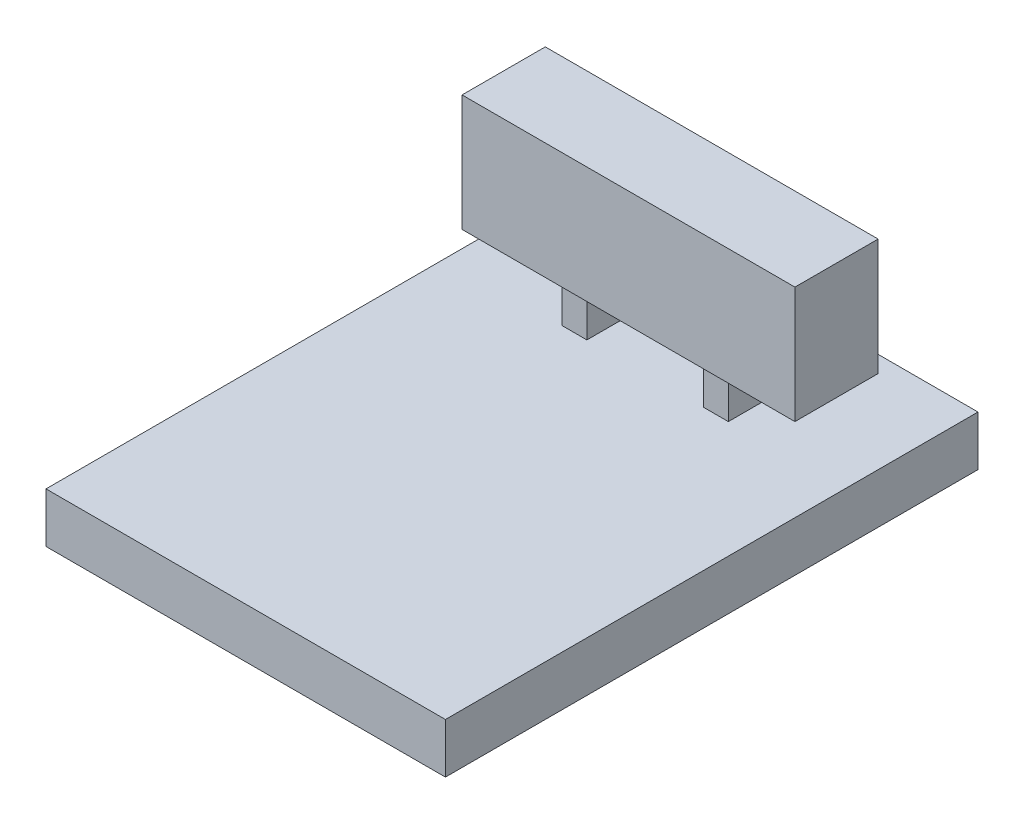
ISO-10303-21;
HEADER;
FILE_DESCRIPTION(('STEP AP214'),'2;1');
FILE_NAME('part.step','',(''),(''),'','','');
FILE_SCHEMA(('AUTOMOTIVE_DESIGN { 1 0 10303 214 1 1 1 1 }'));
ENDSEC;
DATA;
#1=APPLICATION_CONTEXT('core data for automotive mechanical design processes');
#2=APPLICATION_PROTOCOL_DEFINITION('international standard','automotive_design',2000,#1);
#3=PRODUCT_CONTEXT('',#1,'mechanical');
#4=PRODUCT('Part','Part','',(#3));
#5=PRODUCT_RELATED_PRODUCT_CATEGORY('part','',(#4));
#6=PRODUCT_DEFINITION_FORMATION('','',#4);
#7=PRODUCT_DEFINITION_CONTEXT('part definition',#1,'design');
#8=PRODUCT_DEFINITION('design','',#6,#7);
#9=PRODUCT_DEFINITION_SHAPE('','',#8);
#10=(LENGTH_UNIT() NAMED_UNIT(*) SI_UNIT(.MILLI.,.METRE.));
#11=(NAMED_UNIT(*) PLANE_ANGLE_UNIT() SI_UNIT($,.RADIAN.));
#12=(NAMED_UNIT(*) SI_UNIT($,.STERADIAN.) SOLID_ANGLE_UNIT());
#13=UNCERTAINTY_MEASURE_WITH_UNIT(LENGTH_MEASURE(1.E-05),#10,'distance_accuracy_value','');
#14=(GEOMETRIC_REPRESENTATION_CONTEXT(3) GLOBAL_UNCERTAINTY_ASSIGNED_CONTEXT((#13)) GLOBAL_UNIT_ASSIGNED_CONTEXT((#10,
#11,#12)) REPRESENTATION_CONTEXT('',''));
#15=CARTESIAN_POINT('',(0.,0.,0.));
#16=DIRECTION('',(0.,0.,1.));
#17=DIRECTION('',(1.,0.,0.));
#18=AXIS2_PLACEMENT_3D('',#15,#16,#17);
#19=CARTESIAN_POINT('',(0.,3.,0.));
#20=DIRECTION('',(0.,1.,0.));
#21=DIRECTION('',(0.,0.,1.));
#22=AXIS2_PLACEMENT_3D('',#19,#20,#21);
#23=PLANE('',#22);
#24=DIRECTION('',(1.,0.,0.));
#25=VECTOR('',#24,1.);
#26=CARTESIAN_POINT('',(-15.3304347826087,3.,-9.63478260869564));
#27=LINE('',#26,#25);
#28=CARTESIAN_POINT('',(-15.3304347826087,3.,-9.63478260869564));
#29=VERTEX_POINT('',#28);
#30=CARTESIAN_POINT('',(-13.8304347826087,3.,-9.63478260869564));
#31=VERTEX_POINT('',#30);
#32=EDGE_CURVE('E223',#29,#31,#27,.T.);
#33=ORIENTED_EDGE('',*,*,#32,.F.);
#34=DIRECTION('',(0.,0.,1.));
#35=VECTOR('',#34,1.);
#36=CARTESIAN_POINT('',(-15.3304347826087,3.,-12.6347826086956));
#37=LINE('',#36,#35);
#38=CARTESIAN_POINT('',(-15.3304347826087,3.,-12.6347826086956));
#39=VERTEX_POINT('',#38);
#40=EDGE_CURVE('E206',#39,#29,#37,.T.);
#41=ORIENTED_EDGE('',*,*,#40,.F.);
#42=DIRECTION('',(-1.,0.,0.));
#43=VECTOR('',#42,1.);
#44=CARTESIAN_POINT('',(-15.3304347826087,3.,-12.6347826086956));
#45=LINE('',#44,#43);
#46=CARTESIAN_POINT('',(-13.8304347826087,3.,-12.6347826086956));
#47=VERTEX_POINT('',#46);
#48=EDGE_CURVE('E211',#47,#39,#45,.T.);
#49=ORIENTED_EDGE('',*,*,#48,.F.);
#50=DIRECTION('',(0.,0.,-1.));
#51=VECTOR('',#50,1.);
#52=CARTESIAN_POINT('',(-13.8304347826087,3.,-12.6347826086956));
#53=LINE('',#52,#51);
#54=EDGE_CURVE('E225',#31,#47,#53,.T.);
#55=ORIENTED_EDGE('',*,*,#54,.F.);
#56=EDGE_LOOP('',(#33,#41,#49,#55));
#57=FACE_BOUND('',#56,.T.);
#58=DIRECTION('',(0.,0.,1.));
#59=VECTOR('',#58,1.);
#60=CARTESIAN_POINT('',(-22.3304347826087,3.,-17.6347826086956));
#61=LINE('',#60,#59);
#62=CARTESIAN_POINT('',(-22.3304347826087,3.,-17.6347826086956));
#63=VERTEX_POINT('',#62);
#64=CARTESIAN_POINT('',(-22.3304347826087,3.,14.3652173913044));
#65=VERTEX_POINT('',#64);
#66=EDGE_CURVE('E237',#63,#65,#61,.T.);
#67=ORIENTED_EDGE('',*,*,#66,.T.);
#68=DIRECTION('',(1.,0.,0.));
#69=VECTOR('',#68,1.);
#70=CARTESIAN_POINT('',(-22.3304347826087,3.,14.3652173913044));
#71=LINE('',#70,#69);
#72=CARTESIAN_POINT('',(1.66956521739132,3.,14.3652173913044));
#73=VERTEX_POINT('',#72);
#74=EDGE_CURVE('E240',#65,#73,#71,.T.);
#75=ORIENTED_EDGE('',*,*,#74,.T.);
#76=DIRECTION('',(0.,0.,-1.));
#77=VECTOR('',#76,1.);
#78=CARTESIAN_POINT('',(1.66956521739132,3.,-17.6347826086956));
#79=LINE('',#78,#77);
#80=CARTESIAN_POINT('',(1.66956521739132,3.,-17.6347826086956));
#81=VERTEX_POINT('',#80);
#82=EDGE_CURVE('E243',#73,#81,#79,.T.);
#83=ORIENTED_EDGE('',*,*,#82,.T.);
#84=DIRECTION('',(-1.,0.,0.));
#85=VECTOR('',#84,1.);
#86=CARTESIAN_POINT('',(-22.3304347826087,3.,-17.6347826086956));
#87=LINE('',#86,#85);
#88=EDGE_CURVE('E245',#81,#63,#87,.T.);
#89=ORIENTED_EDGE('',*,*,#88,.T.);
#90=EDGE_LOOP('',(#67,#75,#83,#89));
#91=FACE_BOUND('',#90,.T.);
#92=DIRECTION('',(0.,0.,1.));
#93=VECTOR('',#92,1.);
#94=CARTESIAN_POINT('',(-6.83043478260868,3.,-12.6347826086956));
#95=LINE('',#94,#93);
#96=CARTESIAN_POINT('',(-6.83043478260868,3.,-12.6347826086956));
#97=VERTEX_POINT('',#96);
#98=CARTESIAN_POINT('',(-6.83043478260868,3.,-9.63478260869564));
#99=VERTEX_POINT('',#98);
#100=EDGE_CURVE('E174',#97,#99,#95,.T.);
#101=ORIENTED_EDGE('',*,*,#100,.F.);
#102=DIRECTION('',(-1.,0.,0.));
#103=VECTOR('',#102,1.);
#104=CARTESIAN_POINT('',(-6.83043478260868,3.,-12.6347826086956));
#105=LINE('',#104,#103);
#106=CARTESIAN_POINT('',(-5.33043478260868,3.,-12.6347826086956));
#107=VERTEX_POINT('',#106);
#108=EDGE_CURVE('E171',#107,#97,#105,.T.);
#109=ORIENTED_EDGE('',*,*,#108,.F.);
#110=DIRECTION('',(0.,0.,-1.));
#111=VECTOR('',#110,1.);
#112=CARTESIAN_POINT('',(-5.33043478260868,3.,-12.6347826086956));
#113=LINE('',#112,#111);
#114=CARTESIAN_POINT('',(-5.33043478260868,3.,-9.63478260869564));
#115=VERTEX_POINT('',#114);
#116=EDGE_CURVE('E184',#115,#107,#113,.T.);
#117=ORIENTED_EDGE('',*,*,#116,.F.);
#118=DIRECTION('',(1.,0.,0.));
#119=VECTOR('',#118,1.);
#120=CARTESIAN_POINT('',(-6.83043478260868,3.,-9.63478260869564));
#121=LINE('',#120,#119);
#122=EDGE_CURVE('E195',#99,#115,#121,.T.);
#123=ORIENTED_EDGE('',*,*,#122,.F.);
#124=EDGE_LOOP('',(#101,#109,#117,#123));
#125=FACE_BOUND('',#124,.T.);
#126=ADVANCED_FACE('F33',(#57,#91,#125),#23,.T.);
#127=CARTESIAN_POINT('',(-22.3304347826087,3.,-17.6347826086956));
#128=DIRECTION('',(1.,0.,0.));
#129=DIRECTION('',(0.,0.,-1.));
#130=AXIS2_PLACEMENT_3D('',#127,#128,#129);
#131=PLANE('',#130);
#132=DIRECTION('',(0.,0.,1.));
#133=VECTOR('',#132,1.);
#134=CARTESIAN_POINT('',(-22.3304347826087,0.,-17.6347826086956));
#135=LINE('',#134,#133);
#136=CARTESIAN_POINT('',(-22.3304347826087,0.,-17.6347826086956));
#137=VERTEX_POINT('',#136);
#138=CARTESIAN_POINT('',(-22.3304347826087,0.,14.3652173913044));
#139=VERTEX_POINT('',#138);
#140=EDGE_CURVE('E236',#137,#139,#135,.T.);
#141=ORIENTED_EDGE('',*,*,#140,.T.);
#142=DIRECTION('',(0.,-1.,0.));
#143=VECTOR('',#142,1.);
#144=CARTESIAN_POINT('',(-22.3304347826087,3.,14.3652173913044));
#145=LINE('',#144,#143);
#146=EDGE_CURVE('E11',#65,#139,#145,.T.);
#147=ORIENTED_EDGE('',*,*,#146,.F.);
#148=ORIENTED_EDGE('',*,*,#66,.F.);
#149=DIRECTION('',(0.,-1.,0.));
#150=VECTOR('',#149,1.);
#151=CARTESIAN_POINT('',(-22.3304347826087,3.,-17.6347826086956));
#152=LINE('',#151,#150);
#153=EDGE_CURVE('E247',#63,#137,#152,.T.);
#154=ORIENTED_EDGE('',*,*,#153,.T.);
#155=EDGE_LOOP('',(#141,#147,#148,#154));
#156=FACE_BOUND('',#155,.T.);
#157=ADVANCED_FACE('F35',(#156),#131,.F.);
#158=CARTESIAN_POINT('',(-22.3304347826087,3.,14.3652173913044));
#159=DIRECTION('',(0.,0.,-1.));
#160=DIRECTION('',(-1.,0.,0.));
#161=AXIS2_PLACEMENT_3D('',#158,#159,#160);
#162=PLANE('',#161);
#163=DIRECTION('',(1.,0.,0.));
#164=VECTOR('',#163,1.);
#165=CARTESIAN_POINT('',(-22.3304347826087,0.,14.3652173913044));
#166=LINE('',#165,#164);
#167=CARTESIAN_POINT('',(1.66956521739132,0.,14.3652173913044));
#168=VERTEX_POINT('',#167);
#169=EDGE_CURVE('E250',#139,#168,#166,.T.);
#170=ORIENTED_EDGE('',*,*,#169,.T.);
#171=DIRECTION('',(0.,-1.,0.));
#172=VECTOR('',#171,1.);
#173=CARTESIAN_POINT('',(1.66956521739132,3.,14.3652173913044));
#174=LINE('',#173,#172);
#175=EDGE_CURVE('E41',#73,#168,#174,.T.);
#176=ORIENTED_EDGE('',*,*,#175,.F.);
#177=ORIENTED_EDGE('',*,*,#74,.F.);
#178=ORIENTED_EDGE('',*,*,#146,.T.);
#179=EDGE_LOOP('',(#170,#176,#177,#178));
#180=FACE_BOUND('',#179,.T.);
#181=ADVANCED_FACE('F280',(#180),#162,.F.);
#182=CARTESIAN_POINT('',(1.66956521739132,3.,-17.6347826086956));
#183=DIRECTION('',(-1.,0.,0.));
#184=DIRECTION('',(0.,0.,1.));
#185=AXIS2_PLACEMENT_3D('',#182,#183,#184);
#186=PLANE('',#185);
#187=DIRECTION('',(0.,0.,-1.));
#188=VECTOR('',#187,1.);
#189=CARTESIAN_POINT('',(1.66956521739132,0.,-17.6347826086956));
#190=LINE('',#189,#188);
#191=CARTESIAN_POINT('',(1.66956521739132,0.,-17.6347826086956));
#192=VERTEX_POINT('',#191);
#193=EDGE_CURVE('E252',#168,#192,#190,.T.);
#194=ORIENTED_EDGE('',*,*,#193,.T.);
#195=DIRECTION('',(0.,-1.,0.));
#196=VECTOR('',#195,1.);
#197=CARTESIAN_POINT('',(1.66956521739132,3.,-17.6347826086956));
#198=LINE('',#197,#196);
#199=EDGE_CURVE('E257',#81,#192,#198,.T.);
#200=ORIENTED_EDGE('',*,*,#199,.F.);
#201=ORIENTED_EDGE('',*,*,#82,.F.);
#202=ORIENTED_EDGE('',*,*,#175,.T.);
#203=EDGE_LOOP('',(#194,#200,#201,#202));
#204=FACE_BOUND('',#203,.T.);
#205=ADVANCED_FACE('F264',(#204),#186,.F.);
#206=CARTESIAN_POINT('',(-22.3304347826087,3.,-17.6347826086956));
#207=DIRECTION('',(0.,0.,1.));
#208=DIRECTION('',(1.,0.,0.));
#209=AXIS2_PLACEMENT_3D('',#206,#207,#208);
#210=PLANE('',#209);
#211=DIRECTION('',(-1.,0.,0.));
#212=VECTOR('',#211,1.);
#213=CARTESIAN_POINT('',(-22.3304347826087,0.,-17.6347826086956));
#214=LINE('',#213,#212);
#215=EDGE_CURVE('E241',#192,#137,#214,.T.);
#216=ORIENTED_EDGE('',*,*,#215,.T.);
#217=ORIENTED_EDGE('',*,*,#153,.F.);
#218=ORIENTED_EDGE('',*,*,#88,.F.);
#219=ORIENTED_EDGE('',*,*,#199,.T.);
#220=EDGE_LOOP('',(#216,#217,#218,#219));
#221=FACE_BOUND('',#220,.T.);
#222=ADVANCED_FACE('F273',(#221),#210,.F.);
#223=CARTESIAN_POINT('',(0.,0.,0.));
#224=DIRECTION('',(0.,1.,0.));
#225=DIRECTION('',(0.,0.,1.));
#226=AXIS2_PLACEMENT_3D('',#223,#224,#225);
#227=PLANE('',#226);
#228=ORIENTED_EDGE('',*,*,#140,.F.);
#229=ORIENTED_EDGE('',*,*,#215,.F.);
#230=ORIENTED_EDGE('',*,*,#193,.F.);
#231=ORIENTED_EDGE('',*,*,#169,.F.);
#232=EDGE_LOOP('',(#228,#229,#230,#231));
#233=FACE_BOUND('',#232,.T.);
#234=ADVANCED_FACE('F270',(#233),#227,.F.);
#235=CARTESIAN_POINT('',(-15.3304347826087,6.,-12.6347826086956));
#236=DIRECTION('',(1.,0.,0.));
#237=DIRECTION('',(0.,0.,-1.));
#238=AXIS2_PLACEMENT_3D('',#235,#236,#237);
#239=PLANE('',#238);
#240=ORIENTED_EDGE('',*,*,#40,.T.);
#241=DIRECTION('',(0.,-1.,0.));
#242=VECTOR('',#241,1.);
#243=CARTESIAN_POINT('',(-15.3304347826087,6.,-9.63478260869564));
#244=LINE('',#243,#242);
#245=CARTESIAN_POINT('',(-15.3304347826087,6.,-9.63478260869564));
#246=VERTEX_POINT('',#245);
#247=EDGE_CURVE('E234',#246,#29,#244,.T.);
#248=ORIENTED_EDGE('',*,*,#247,.F.);
#249=DIRECTION('',(0.,0.,1.));
#250=VECTOR('',#249,1.);
#251=CARTESIAN_POINT('',(-15.3304347826087,6.,-12.6347826086956));
#252=LINE('',#251,#250);
#253=CARTESIAN_POINT('',(-15.3304347826087,6.,-12.6347826086956));
#254=VERTEX_POINT('',#253);
#255=EDGE_CURVE('E207',#254,#246,#252,.T.);
#256=ORIENTED_EDGE('',*,*,#255,.F.);
#257=DIRECTION('',(0.,-1.,0.));
#258=VECTOR('',#257,1.);
#259=CARTESIAN_POINT('',(-15.3304347826087,6.,-12.6347826086956));
#260=LINE('',#259,#258);
#261=EDGE_CURVE('E220',#254,#39,#260,.T.);
#262=ORIENTED_EDGE('',*,*,#261,.T.);
#263=EDGE_LOOP('',(#240,#248,#256,#262));
#264=FACE_BOUND('',#263,.T.);
#265=ADVANCED_FACE('F295',(#264),#239,.F.);
#266=CARTESIAN_POINT('',(-15.3304347826087,6.,-9.63478260869564));
#267=DIRECTION('',(0.,0.,-1.));
#268=DIRECTION('',(-1.,0.,0.));
#269=AXIS2_PLACEMENT_3D('',#266,#267,#268);
#270=PLANE('',#269);
#271=ORIENTED_EDGE('',*,*,#32,.T.);
#272=DIRECTION('',(0.,-1.,0.));
#273=VECTOR('',#272,1.);
#274=CARTESIAN_POINT('',(-13.8304347826087,6.,-9.63478260869564));
#275=LINE('',#274,#273);
#276=CARTESIAN_POINT('',(-13.8304347826087,6.,-9.63478260869564));
#277=VERTEX_POINT('',#276);
#278=EDGE_CURVE('E231',#277,#31,#275,.T.);
#279=ORIENTED_EDGE('',*,*,#278,.F.);
#280=DIRECTION('',(1.,0.,0.));
#281=VECTOR('',#280,1.);
#282=CARTESIAN_POINT('',(-15.3304347826087,6.,-9.63478260869564));
#283=LINE('',#282,#281);
#284=EDGE_CURVE('E210',#246,#277,#283,.T.);
#285=ORIENTED_EDGE('',*,*,#284,.F.);
#286=ORIENTED_EDGE('',*,*,#247,.T.);
#287=EDGE_LOOP('',(#271,#279,#285,#286));
#288=FACE_BOUND('',#287,.T.);
#289=ADVANCED_FACE('F314',(#288),#270,.F.);
#290=CARTESIAN_POINT('',(-13.8304347826087,6.,-12.6347826086956));
#291=DIRECTION('',(-1.,0.,0.));
#292=DIRECTION('',(0.,0.,1.));
#293=AXIS2_PLACEMENT_3D('',#290,#291,#292);
#294=PLANE('',#293);
#295=ORIENTED_EDGE('',*,*,#54,.T.);
#296=DIRECTION('',(0.,-1.,0.));
#297=VECTOR('',#296,1.);
#298=CARTESIAN_POINT('',(-13.8304347826087,6.,-12.6347826086956));
#299=LINE('',#298,#297);
#300=CARTESIAN_POINT('',(-13.8304347826087,6.,-12.6347826086956));
#301=VERTEX_POINT('',#300);
#302=EDGE_CURVE('E56',#301,#47,#299,.T.);
#303=ORIENTED_EDGE('',*,*,#302,.F.);
#304=DIRECTION('',(0.,0.,-1.));
#305=VECTOR('',#304,1.);
#306=CARTESIAN_POINT('',(-13.8304347826087,6.,-12.6347826086956));
#307=LINE('',#306,#305);
#308=EDGE_CURVE('E214',#277,#301,#307,.T.);
#309=ORIENTED_EDGE('',*,*,#308,.F.);
#310=ORIENTED_EDGE('',*,*,#278,.T.);
#311=EDGE_LOOP('',(#295,#303,#309,#310));
#312=FACE_BOUND('',#311,.T.);
#313=ADVANCED_FACE('F321',(#312),#294,.F.);
#314=CARTESIAN_POINT('',(-15.3304347826087,6.,-12.6347826086956));
#315=DIRECTION('',(0.,0.,1.));
#316=DIRECTION('',(1.,0.,0.));
#317=AXIS2_PLACEMENT_3D('',#314,#315,#316);
#318=PLANE('',#317);
#319=ORIENTED_EDGE('',*,*,#48,.T.);
#320=ORIENTED_EDGE('',*,*,#261,.F.);
#321=DIRECTION('',(-1.,0.,0.));
#322=VECTOR('',#321,1.);
#323=CARTESIAN_POINT('',(-15.3304347826087,6.,-12.6347826086956));
#324=LINE('',#323,#322);
#325=EDGE_CURVE('E217',#301,#254,#324,.T.);
#326=ORIENTED_EDGE('',*,*,#325,.F.);
#327=ORIENTED_EDGE('',*,*,#302,.T.);
#328=EDGE_LOOP('',(#319,#320,#326,#327));
#329=FACE_BOUND('',#328,.T.);
#330=ADVANCED_FACE('F328',(#329),#318,.F.);
#331=CARTESIAN_POINT('',(-6.83043478260868,6.,-12.6347826086956));
#332=DIRECTION('',(0.,0.,1.));
#333=DIRECTION('',(1.,0.,0.));
#334=AXIS2_PLACEMENT_3D('',#331,#332,#333);
#335=PLANE('',#334);
#336=ORIENTED_EDGE('',*,*,#108,.T.);
#337=DIRECTION('',(0.,-1.,0.));
#338=VECTOR('',#337,1.);
#339=CARTESIAN_POINT('',(-6.83043478260868,6.,-12.6347826086956));
#340=LINE('',#339,#338);
#341=CARTESIAN_POINT('',(-6.83043478260868,6.,-12.6347826086956));
#342=VERTEX_POINT('',#341);
#343=EDGE_CURVE('E204',#342,#97,#340,.T.);
#344=ORIENTED_EDGE('',*,*,#343,.F.);
#345=DIRECTION('',(-1.,0.,0.));
#346=VECTOR('',#345,1.);
#347=CARTESIAN_POINT('',(-6.83043478260868,6.,-12.6347826086956));
#348=LINE('',#347,#346);
#349=CARTESIAN_POINT('',(-5.33043478260868,6.,-12.6347826086956));
#350=VERTEX_POINT('',#349);
#351=EDGE_CURVE('E180',#350,#342,#348,.T.);
#352=ORIENTED_EDGE('',*,*,#351,.F.);
#353=DIRECTION('',(0.,-1.,0.));
#354=VECTOR('',#353,1.);
#355=CARTESIAN_POINT('',(-5.33043478260868,6.,-12.6347826086956));
#356=LINE('',#355,#354);
#357=EDGE_CURVE('E192',#350,#107,#356,.T.);
#358=ORIENTED_EDGE('',*,*,#357,.T.);
#359=EDGE_LOOP('',(#336,#344,#352,#358));
#360=FACE_BOUND('',#359,.T.);
#361=ADVANCED_FACE('F336',(#360),#335,.F.);
#362=CARTESIAN_POINT('',(-6.83043478260868,6.,-12.6347826086956));
#363=DIRECTION('',(1.,0.,0.));
#364=DIRECTION('',(0.,0.,-1.));
#365=AXIS2_PLACEMENT_3D('',#362,#363,#364);
#366=PLANE('',#365);
#367=ORIENTED_EDGE('',*,*,#100,.T.);
#368=DIRECTION('',(0.,-1.,0.));
#369=VECTOR('',#368,1.);
#370=CARTESIAN_POINT('',(-6.83043478260868,6.,-9.63478260869564));
#371=LINE('',#370,#369);
#372=CARTESIAN_POINT('',(-6.83043478260868,6.,-9.63478260869564));
#373=VERTEX_POINT('',#372);
#374=EDGE_CURVE('E201',#373,#99,#371,.T.);
#375=ORIENTED_EDGE('',*,*,#374,.F.);
#376=DIRECTION('',(0.,0.,1.));
#377=VECTOR('',#376,1.);
#378=CARTESIAN_POINT('',(-6.83043478260868,6.,-12.6347826086956));
#379=LINE('',#378,#377);
#380=EDGE_CURVE('E183',#342,#373,#379,.T.);
#381=ORIENTED_EDGE('',*,*,#380,.F.);
#382=ORIENTED_EDGE('',*,*,#343,.T.);
#383=EDGE_LOOP('',(#367,#375,#381,#382));
#384=FACE_BOUND('',#383,.T.);
#385=ADVANCED_FACE('F343',(#384),#366,.F.);
#386=CARTESIAN_POINT('',(-6.83043478260868,6.,-9.63478260869564));
#387=DIRECTION('',(0.,0.,-1.));
#388=DIRECTION('',(-1.,0.,0.));
#389=AXIS2_PLACEMENT_3D('',#386,#387,#388);
#390=PLANE('',#389);
#391=ORIENTED_EDGE('',*,*,#122,.T.);
#392=DIRECTION('',(0.,-1.,0.));
#393=VECTOR('',#392,1.);
#394=CARTESIAN_POINT('',(-5.33043478260868,6.,-9.63478260869564));
#395=LINE('',#394,#393);
#396=CARTESIAN_POINT('',(-5.33043478260868,6.,-9.63478260869564));
#397=VERTEX_POINT('',#396);
#398=EDGE_CURVE('E48',#397,#115,#395,.T.);
#399=ORIENTED_EDGE('',*,*,#398,.F.);
#400=DIRECTION('',(1.,0.,0.));
#401=VECTOR('',#400,1.);
#402=CARTESIAN_POINT('',(-6.83043478260868,6.,-9.63478260869564));
#403=LINE('',#402,#401);
#404=EDGE_CURVE('E187',#373,#397,#403,.T.);
#405=ORIENTED_EDGE('',*,*,#404,.F.);
#406=ORIENTED_EDGE('',*,*,#374,.T.);
#407=EDGE_LOOP('',(#391,#399,#405,#406));
#408=FACE_BOUND('',#407,.T.);
#409=ADVANCED_FACE('F351',(#408),#390,.F.);
#410=CARTESIAN_POINT('',(-5.33043478260868,6.,-12.6347826086956));
#411=DIRECTION('',(-1.,0.,0.));
#412=DIRECTION('',(0.,0.,1.));
#413=AXIS2_PLACEMENT_3D('',#410,#411,#412);
#414=PLANE('',#413);
#415=ORIENTED_EDGE('',*,*,#116,.T.);
#416=ORIENTED_EDGE('',*,*,#357,.F.);
#417=DIRECTION('',(0.,0.,-1.));
#418=VECTOR('',#417,1.);
#419=CARTESIAN_POINT('',(-5.33043478260868,6.,-12.6347826086956));
#420=LINE('',#419,#418);
#421=EDGE_CURVE('E190',#397,#350,#420,.T.);
#422=ORIENTED_EDGE('',*,*,#421,.F.);
#423=ORIENTED_EDGE('',*,*,#398,.T.);
#424=EDGE_LOOP('',(#415,#416,#422,#423));
#425=FACE_BOUND('',#424,.T.);
#426=ADVANCED_FACE('F359',(#425),#414,.F.);
#427=CARTESIAN_POINT('',(0.,6.,0.));
#428=DIRECTION('',(0.,1.,0.));
#429=DIRECTION('',(0.,0.,1.));
#430=AXIS2_PLACEMENT_3D('',#427,#428,#429);
#431=PLANE('',#430);
#432=ORIENTED_EDGE('',*,*,#421,.T.);
#433=ORIENTED_EDGE('',*,*,#351,.T.);
#434=ORIENTED_EDGE('',*,*,#380,.T.);
#435=ORIENTED_EDGE('',*,*,#404,.T.);
#436=EDGE_LOOP('',(#432,#433,#434,#435));
#437=FACE_BOUND('',#436,.T.);
#438=DIRECTION('',(0.,0.,1.));
#439=VECTOR('',#438,1.);
#440=CARTESIAN_POINT('',(-20.3304347826087,6.,-13.6347826086956));
#441=LINE('',#440,#439);
#442=CARTESIAN_POINT('',(-20.3304347826087,6.,-13.6347826086956));
#443=VERTEX_POINT('',#442);
#444=CARTESIAN_POINT('',(-20.3304347826087,6.,-8.63478260869564));
#445=VERTEX_POINT('',#444);
#446=EDGE_CURVE('E170',#443,#445,#441,.T.);
#447=ORIENTED_EDGE('',*,*,#446,.F.);
#448=DIRECTION('',(-1.,0.,0.));
#449=VECTOR('',#448,1.);
#450=CARTESIAN_POINT('',(-20.3304347826087,6.,-13.6347826086956));
#451=LINE('',#450,#449);
#452=CARTESIAN_POINT('',(-0.33043478260868,6.,-13.6347826086956));
#453=VERTEX_POINT('',#452);
#454=EDGE_CURVE('E166',#453,#443,#451,.T.);
#455=ORIENTED_EDGE('',*,*,#454,.F.);
#456=DIRECTION('',(0.,0.,-1.));
#457=VECTOR('',#456,1.);
#458=CARTESIAN_POINT('',(-0.33043478260868,6.,-13.6347826086956));
#459=LINE('',#458,#457);
#460=CARTESIAN_POINT('',(-0.33043478260868,6.,-8.63478260869564));
#461=VERTEX_POINT('',#460);
#462=EDGE_CURVE('E467',#461,#453,#459,.T.);
#463=ORIENTED_EDGE('',*,*,#462,.F.);
#464=DIRECTION('',(1.,0.,0.));
#465=VECTOR('',#464,1.);
#466=CARTESIAN_POINT('',(-20.3304347826087,6.,-8.63478260869564));
#467=LINE('',#466,#465);
#468=EDGE_CURVE('E471',#445,#461,#467,.T.);
#469=ORIENTED_EDGE('',*,*,#468,.F.);
#470=EDGE_LOOP('',(#447,#455,#463,#469));
#471=FACE_BOUND('',#470,.T.);
#472=ORIENTED_EDGE('',*,*,#325,.T.);
#473=ORIENTED_EDGE('',*,*,#255,.T.);
#474=ORIENTED_EDGE('',*,*,#284,.T.);
#475=ORIENTED_EDGE('',*,*,#308,.T.);
#476=EDGE_LOOP('',(#472,#473,#474,#475));
#477=FACE_BOUND('',#476,.T.);
#478=ADVANCED_FACE('F367',(#437,#471,#477),#431,.F.);
#479=CARTESIAN_POINT('',(-20.3304347826087,13.,-13.6347826086956));
#480=DIRECTION('',(1.,0.,0.));
#481=DIRECTION('',(0.,0.,-1.));
#482=AXIS2_PLACEMENT_3D('',#479,#480,#481);
#483=PLANE('',#482);
#484=ORIENTED_EDGE('',*,*,#446,.T.);
#485=DIRECTION('',(0.,-1.,0.));
#486=VECTOR('',#485,1.);
#487=CARTESIAN_POINT('',(-20.3304347826087,13.,-8.63478260869564));
#488=LINE('',#487,#486);
#489=CARTESIAN_POINT('',(-20.3304347826087,13.,-8.63478260869564));
#490=VERTEX_POINT('',#489);
#491=EDGE_CURVE('E150',#490,#445,#488,.T.);
#492=ORIENTED_EDGE('',*,*,#491,.F.);
#493=DIRECTION('',(0.,0.,1.));
#494=VECTOR('',#493,1.);
#495=CARTESIAN_POINT('',(-20.3304347826087,13.,-13.6347826086956));
#496=LINE('',#495,#494);
#497=CARTESIAN_POINT('',(-20.3304347826087,13.,-13.6347826086956));
#498=VERTEX_POINT('',#497);
#499=EDGE_CURVE('E157',#498,#490,#496,.T.);
#500=ORIENTED_EDGE('',*,*,#499,.F.);
#501=DIRECTION('',(0.,-1.,0.));
#502=VECTOR('',#501,1.);
#503=CARTESIAN_POINT('',(-20.3304347826087,13.,-13.6347826086956));
#504=LINE('',#503,#502);
#505=EDGE_CURVE('E463',#498,#443,#504,.T.);
#506=ORIENTED_EDGE('',*,*,#505,.T.);
#507=EDGE_LOOP('',(#484,#492,#500,#506));
#508=FACE_BOUND('',#507,.T.);
#509=ADVANCED_FACE('F168',(#508),#483,.F.);
#510=CARTESIAN_POINT('',(-20.3304347826087,13.,-8.63478260869564));
#511=DIRECTION('',(0.,0.,-1.));
#512=DIRECTION('',(-1.,0.,0.));
#513=AXIS2_PLACEMENT_3D('',#510,#511,#512);
#514=PLANE('',#513);
#515=ORIENTED_EDGE('',*,*,#468,.T.);
#516=DIRECTION('',(0.,-1.,0.));
#517=VECTOR('',#516,1.);
#518=CARTESIAN_POINT('',(-0.33043478260868,13.,-8.63478260869564));
#519=LINE('',#518,#517);
#520=CARTESIAN_POINT('',(-0.33043478260868,13.,-8.63478260869564));
#521=VERTEX_POINT('',#520);
#522=EDGE_CURVE('E153',#521,#461,#519,.T.);
#523=ORIENTED_EDGE('',*,*,#522,.F.);
#524=DIRECTION('',(1.,0.,0.));
#525=VECTOR('',#524,1.);
#526=CARTESIAN_POINT('',(-20.3304347826087,13.,-8.63478260869564));
#527=LINE('',#526,#525);
#528=EDGE_CURVE('E146',#490,#521,#527,.T.);
#529=ORIENTED_EDGE('',*,*,#528,.F.);
#530=ORIENTED_EDGE('',*,*,#491,.T.);
#531=EDGE_LOOP('',(#515,#523,#529,#530));
#532=FACE_BOUND('',#531,.T.);
#533=ADVANCED_FACE('F148',(#532),#514,.F.);
#534=CARTESIAN_POINT('',(-0.33043478260868,13.,-13.6347826086956));
#535=DIRECTION('',(-1.,0.,0.));
#536=DIRECTION('',(0.,0.,1.));
#537=AXIS2_PLACEMENT_3D('',#534,#535,#536);
#538=PLANE('',#537);
#539=ORIENTED_EDGE('',*,*,#462,.T.);
#540=DIRECTION('',(0.,-1.,0.));
#541=VECTOR('',#540,1.);
#542=CARTESIAN_POINT('',(-0.33043478260868,13.,-13.6347826086956));
#543=LINE('',#542,#541);
#544=CARTESIAN_POINT('',(-0.33043478260868,13.,-13.6347826086956));
#545=VERTEX_POINT('',#544);
#546=EDGE_CURVE('E176',#545,#453,#543,.T.);
#547=ORIENTED_EDGE('',*,*,#546,.F.);
#548=DIRECTION('',(0.,0.,-1.));
#549=VECTOR('',#548,1.);
#550=CARTESIAN_POINT('',(-0.33043478260868,13.,-13.6347826086956));
#551=LINE('',#550,#549);
#552=EDGE_CURVE('E156',#521,#545,#551,.T.);
#553=ORIENTED_EDGE('',*,*,#552,.F.);
#554=ORIENTED_EDGE('',*,*,#522,.T.);
#555=EDGE_LOOP('',(#539,#547,#553,#554));
#556=FACE_BOUND('',#555,.T.);
#557=ADVANCED_FACE('F387',(#556),#538,.F.);
#558=CARTESIAN_POINT('',(-20.3304347826087,13.,-13.6347826086956));
#559=DIRECTION('',(0.,0.,1.));
#560=DIRECTION('',(1.,0.,0.));
#561=AXIS2_PLACEMENT_3D('',#558,#559,#560);
#562=PLANE('',#561);
#563=ORIENTED_EDGE('',*,*,#454,.T.);
#564=ORIENTED_EDGE('',*,*,#505,.F.);
#565=DIRECTION('',(-1.,0.,0.));
#566=VECTOR('',#565,1.);
#567=CARTESIAN_POINT('',(-20.3304347826087,13.,-13.6347826086956));
#568=LINE('',#567,#566);
#569=EDGE_CURVE('E162',#545,#498,#568,.T.);
#570=ORIENTED_EDGE('',*,*,#569,.F.);
#571=ORIENTED_EDGE('',*,*,#546,.T.);
#572=EDGE_LOOP('',(#563,#564,#570,#571));
#573=FACE_BOUND('',#572,.T.);
#574=ADVANCED_FACE('F394',(#573),#562,.F.);
#575=CARTESIAN_POINT('',(0.,13.,0.));
#576=DIRECTION('',(0.,1.,0.));
#577=DIRECTION('',(0.,0.,1.));
#578=AXIS2_PLACEMENT_3D('',#575,#576,#577);
#579=PLANE('',#578);
#580=ORIENTED_EDGE('',*,*,#499,.T.);
#581=ORIENTED_EDGE('',*,*,#528,.T.);
#582=ORIENTED_EDGE('',*,*,#552,.T.);
#583=ORIENTED_EDGE('',*,*,#569,.T.);
#584=EDGE_LOOP('',(#580,#581,#582,#583));
#585=FACE_BOUND('',#584,.T.);
#586=ADVANCED_FACE('F160',(#585),#579,.T.);
#587=CLOSED_SHELL('',(#126,#157,#181,#205,#222,#234,#265,#289,#313,#330,#361,#385,#409,#426,
#478,#509,#533,#557,#574,#586));
#588=MANIFOLD_SOLID_BREP('B2',#587);
#589=ADVANCED_BREP_SHAPE_REPRESENTATION('',(#18,#588),#14);
#590=SHAPE_DEFINITION_REPRESENTATION(#9,#589);
ENDSEC;
END-ISO-10303-21;
